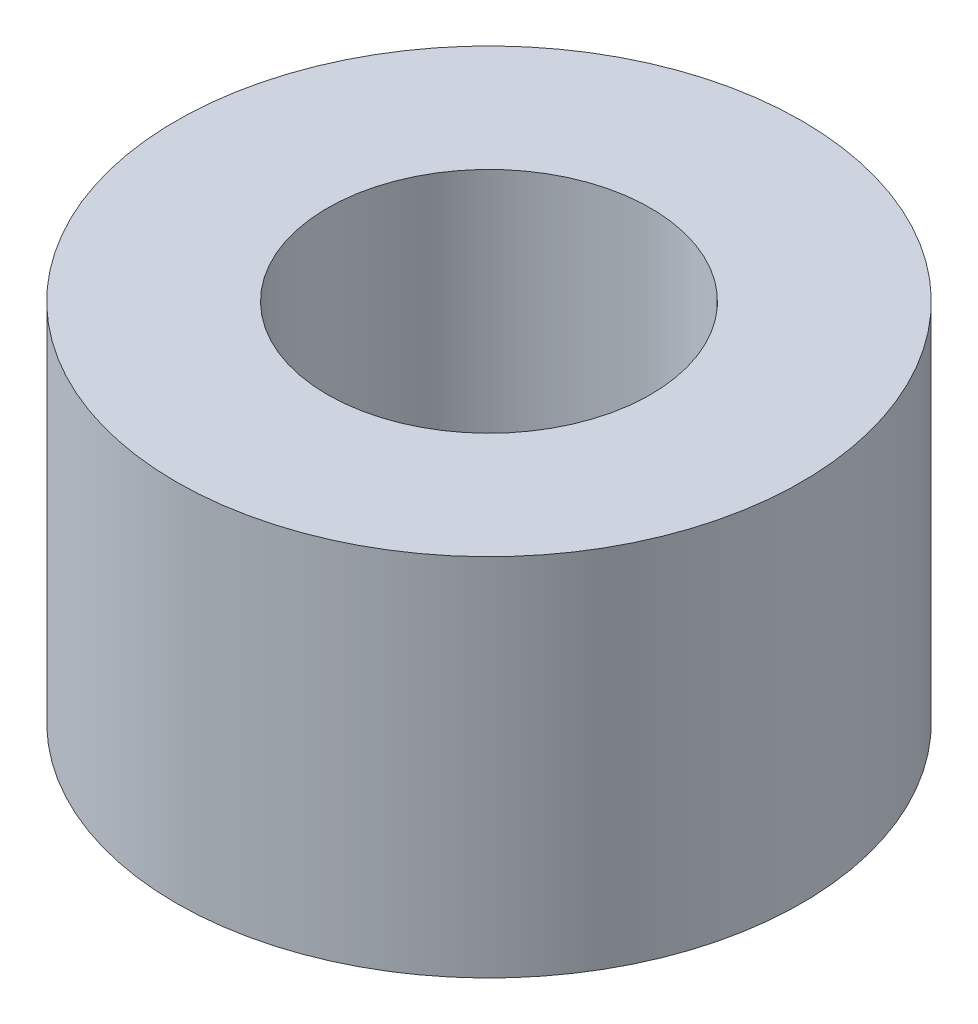
ISO-10303-21;
HEADER;
FILE_DESCRIPTION(('STEP AP214'),'2;1');
FILE_NAME('part.step','',(''),(''),'','','');
FILE_SCHEMA(('AUTOMOTIVE_DESIGN { 1 0 10303 214 1 1 1 1 }'));
ENDSEC;
DATA;
#1=APPLICATION_CONTEXT('core data for automotive mechanical design processes');
#2=APPLICATION_PROTOCOL_DEFINITION('international standard','automotive_design',2000,#1);
#3=PRODUCT_CONTEXT('',#1,'mechanical');
#4=PRODUCT('Part','Part','',(#3));
#5=PRODUCT_RELATED_PRODUCT_CATEGORY('part','',(#4));
#6=PRODUCT_DEFINITION_FORMATION('','',#4);
#7=PRODUCT_DEFINITION_CONTEXT('part definition',#1,'design');
#8=PRODUCT_DEFINITION('design','',#6,#7);
#9=PRODUCT_DEFINITION_SHAPE('','',#8);
#10=(LENGTH_UNIT() NAMED_UNIT(*) SI_UNIT(.MILLI.,.METRE.));
#11=(NAMED_UNIT(*) PLANE_ANGLE_UNIT() SI_UNIT($,.RADIAN.));
#12=(NAMED_UNIT(*) SI_UNIT($,.STERADIAN.) SOLID_ANGLE_UNIT());
#13=UNCERTAINTY_MEASURE_WITH_UNIT(LENGTH_MEASURE(1.E-05),#10,'distance_accuracy_value','');
#14=(GEOMETRIC_REPRESENTATION_CONTEXT(3) GLOBAL_UNCERTAINTY_ASSIGNED_CONTEXT((#13)) GLOBAL_UNIT_ASSIGNED_CONTEXT((#10,
#11,#12)) REPRESENTATION_CONTEXT('',''));
#15=CARTESIAN_POINT('',(0.,0.,0.));
#16=DIRECTION('',(0.,0.,1.));
#17=DIRECTION('',(1.,0.,0.));
#18=AXIS2_PLACEMENT_3D('',#15,#16,#17);
#19=CARTESIAN_POINT('',(0.,3.5,0.));
#20=DIRECTION('',(0.,1.,0.));
#21=DIRECTION('',(0.,0.,1.));
#22=AXIS2_PLACEMENT_3D('',#19,#20,#21);
#23=PLANE('',#22);
#24=CARTESIAN_POINT('',(0.,3.5,0.));
#25=DIRECTION('',(0.,1.,0.));
#26=DIRECTION('',(0.,0.,1.));
#27=AXIS2_PLACEMENT_3D('',#24,#25,#26);
#28=CIRCLE('',#27,3.);
#29=CARTESIAN_POINT('',(0.,3.5,3.));
#30=VERTEX_POINT('',#29);
#31=EDGE_CURVE('E10',#30,#30,#28,.T.);
#32=ORIENTED_EDGE('',*,*,#31,.T.);
#33=EDGE_LOOP('',(#32));
#34=FACE_BOUND('',#33,.T.);
#35=CARTESIAN_POINT('',(0.,3.5,0.));
#36=DIRECTION('',(0.,1.,0.));
#37=DIRECTION('',(0.,0.,1.));
#38=AXIS2_PLACEMENT_3D('',#35,#36,#37);
#39=CIRCLE('',#38,1.55);
#40=CARTESIAN_POINT('',(0.,3.5,1.55));
#41=VERTEX_POINT('',#40);
#42=EDGE_CURVE('E43',#41,#41,#39,.T.);
#43=ORIENTED_EDGE('',*,*,#42,.F.);
#44=EDGE_LOOP('',(#43));
#45=FACE_BOUND('',#44,.T.);
#46=ADVANCED_FACE('F32',(#34,#45),#23,.T.);
#47=CARTESIAN_POINT('',(0.,0.,0.));
#48=DIRECTION('',(0.,1.,0.));
#49=DIRECTION('',(0.,0.,1.));
#50=AXIS2_PLACEMENT_3D('',#47,#48,#49);
#51=PLANE('',#50);
#52=CARTESIAN_POINT('',(0.,0.,0.));
#53=DIRECTION('',(0.,1.,0.));
#54=DIRECTION('',(0.,0.,1.));
#55=AXIS2_PLACEMENT_3D('',#52,#53,#54);
#56=CIRCLE('',#55,3.);
#57=CARTESIAN_POINT('',(0.,0.,3.));
#58=VERTEX_POINT('',#57);
#59=EDGE_CURVE('E36',#58,#58,#56,.T.);
#60=ORIENTED_EDGE('',*,*,#59,.F.);
#61=EDGE_LOOP('',(#60));
#62=FACE_BOUND('',#61,.T.);
#63=CARTESIAN_POINT('',(0.,0.,0.));
#64=DIRECTION('',(0.,1.,0.));
#65=DIRECTION('',(0.,0.,1.));
#66=AXIS2_PLACEMENT_3D('',#63,#64,#65);
#67=CIRCLE('',#66,1.55);
#68=CARTESIAN_POINT('',(0.,0.,1.55));
#69=VERTEX_POINT('',#68);
#70=EDGE_CURVE('E45',#69,#69,#67,.T.);
#71=ORIENTED_EDGE('',*,*,#70,.T.);
#72=EDGE_LOOP('',(#71));
#73=FACE_BOUND('',#72,.T.);
#74=ADVANCED_FACE('F55',(#62,#73),#51,.F.);
#75=CARTESIAN_POINT('',(0.,3.5,0.));
#76=DIRECTION('',(0.,-1.,0.));
#77=DIRECTION('',(0.,0.,-1.));
#78=AXIS2_PLACEMENT_3D('',#75,#76,#77);
#79=CYLINDRICAL_SURFACE('',#78,3.);
#80=ORIENTED_EDGE('',*,*,#31,.F.);
#81=EDGE_LOOP('',(#80));
#82=FACE_BOUND('',#81,.T.);
#83=ORIENTED_EDGE('',*,*,#59,.T.);
#84=EDGE_LOOP('',(#83));
#85=FACE_BOUND('',#84,.T.);
#86=ADVANCED_FACE('F34',(#82,#85),#79,.T.);
#87=CARTESIAN_POINT('',(0.,3.5,0.));
#88=DIRECTION('',(0.,-1.,0.));
#89=DIRECTION('',(0.,0.,-1.));
#90=AXIS2_PLACEMENT_3D('',#87,#88,#89);
#91=CYLINDRICAL_SURFACE('',#90,1.55);
#92=ORIENTED_EDGE('',*,*,#42,.T.);
#93=EDGE_LOOP('',(#92));
#94=FACE_BOUND('',#93,.T.);
#95=ORIENTED_EDGE('',*,*,#70,.F.);
#96=EDGE_LOOP('',(#95));
#97=FACE_BOUND('',#96,.T.);
#98=ADVANCED_FACE('F51',(#94,#97),#91,.F.);
#99=CLOSED_SHELL('',(#46,#74,#86,#98));
#100=MANIFOLD_SOLID_BREP('B2',#99);
#101=ADVANCED_BREP_SHAPE_REPRESENTATION('',(#18,#100),#14);
#102=SHAPE_DEFINITION_REPRESENTATION(#9,#101);
ENDSEC;
END-ISO-10303-21;
